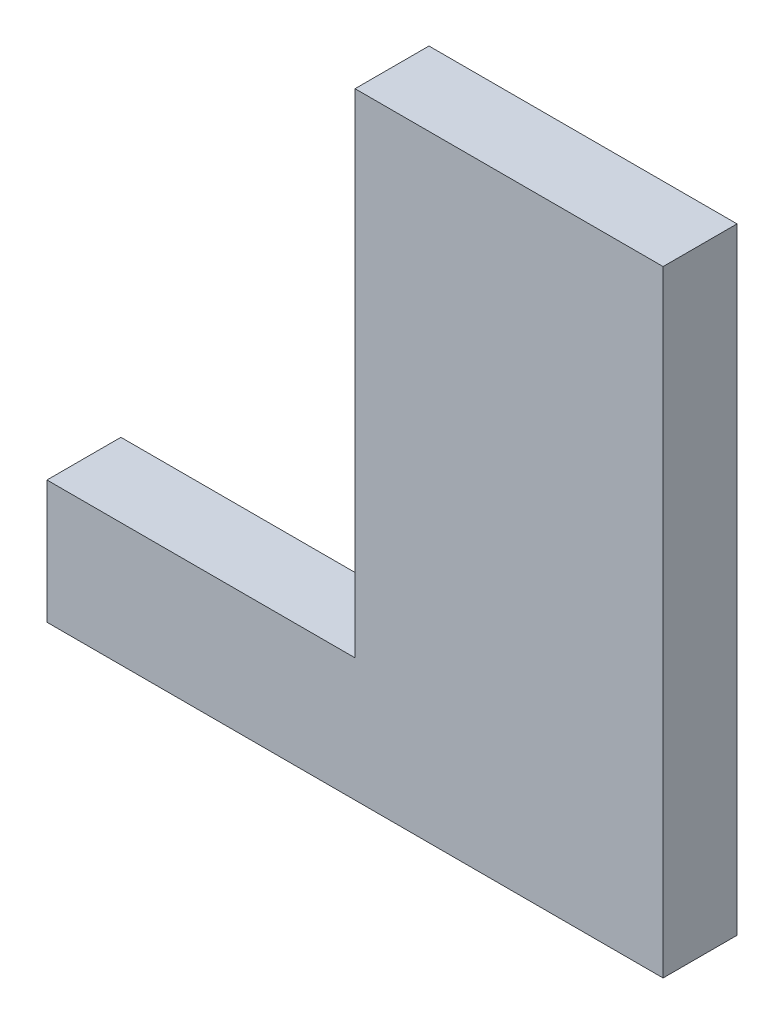
ISO-10303-21;
HEADER;
FILE_DESCRIPTION(('STEP AP214'),'2;1');
FILE_NAME('part.step','',(''),(''),'','','');
FILE_SCHEMA(('AUTOMOTIVE_DESIGN { 1 0 10303 214 1 1 1 1 }'));
ENDSEC;
DATA;
#1=APPLICATION_CONTEXT('core data for automotive mechanical design processes');
#2=APPLICATION_PROTOCOL_DEFINITION('international standard','automotive_design',2000,#1);
#3=PRODUCT_CONTEXT('',#1,'mechanical');
#4=PRODUCT('Part','Part','',(#3));
#5=PRODUCT_RELATED_PRODUCT_CATEGORY('part','',(#4));
#6=PRODUCT_DEFINITION_FORMATION('','',#4);
#7=PRODUCT_DEFINITION_CONTEXT('part definition',#1,'design');
#8=PRODUCT_DEFINITION('design','',#6,#7);
#9=PRODUCT_DEFINITION_SHAPE('','',#8);
#10=(LENGTH_UNIT() NAMED_UNIT(*) SI_UNIT(.MILLI.,.METRE.));
#11=(NAMED_UNIT(*) PLANE_ANGLE_UNIT() SI_UNIT($,.RADIAN.));
#12=(NAMED_UNIT(*) SI_UNIT($,.STERADIAN.) SOLID_ANGLE_UNIT());
#13=UNCERTAINTY_MEASURE_WITH_UNIT(LENGTH_MEASURE(1.E-05),#10,'distance_accuracy_value','');
#14=(GEOMETRIC_REPRESENTATION_CONTEXT(3) GLOBAL_UNCERTAINTY_ASSIGNED_CONTEXT((#13)) GLOBAL_UNIT_ASSIGNED_CONTEXT((#10,
#11,#12)) REPRESENTATION_CONTEXT('',''));
#15=CARTESIAN_POINT('',(0.,0.,0.));
#16=DIRECTION('',(0.,0.,1.));
#17=DIRECTION('',(1.,0.,0.));
#18=AXIS2_PLACEMENT_3D('',#15,#16,#17);
#19=CARTESIAN_POINT('',(0.,25.,-1.5));
#20=DIRECTION('',(0.,0.,-1.));
#21=DIRECTION('',(-1.,0.,0.));
#22=AXIS2_PLACEMENT_3D('',#19,#20,#21);
#23=PLANE('',#22);
#24=DIRECTION('',(1.,0.,0.));
#25=VECTOR('',#24,1.);
#26=CARTESIAN_POINT('',(0.,0.,-1.5));
#27=LINE('',#26,#25);
#28=CARTESIAN_POINT('',(-12.5,0.,-1.5));
#29=VERTEX_POINT('',#28);
#30=CARTESIAN_POINT('',(12.5,0.,-1.5));
#31=VERTEX_POINT('',#30);
#32=EDGE_CURVE('E135',#29,#31,#27,.T.);
#33=ORIENTED_EDGE('',*,*,#32,.F.);
#34=DIRECTION('',(0.,-1.,0.));
#35=VECTOR('',#34,1.);
#36=CARTESIAN_POINT('',(-12.5,5.,-1.5));
#37=LINE('',#36,#35);
#38=CARTESIAN_POINT('',(-12.5,5.,-1.5));
#39=VERTEX_POINT('',#38);
#40=EDGE_CURVE('E110',#39,#29,#37,.T.);
#41=ORIENTED_EDGE('',*,*,#40,.F.);
#42=DIRECTION('',(1.,0.,0.));
#43=VECTOR('',#42,1.);
#44=CARTESIAN_POINT('',(0.,5.,-1.5));
#45=LINE('',#44,#43);
#46=CARTESIAN_POINT('',(0.,5.,-1.5));
#47=VERTEX_POINT('',#46);
#48=EDGE_CURVE('E101',#39,#47,#45,.T.);
#49=ORIENTED_EDGE('',*,*,#48,.T.);
#50=DIRECTION('',(0.,-1.,0.));
#51=VECTOR('',#50,1.);
#52=CARTESIAN_POINT('',(0.,25.,-1.5));
#53=LINE('',#52,#51);
#54=CARTESIAN_POINT('',(0.,25.,-1.5));
#55=VERTEX_POINT('',#54);
#56=EDGE_CURVE('E11',#55,#47,#53,.T.);
#57=ORIENTED_EDGE('',*,*,#56,.F.);
#58=DIRECTION('',(1.,0.,0.));
#59=VECTOR('',#58,1.);
#60=CARTESIAN_POINT('',(0.,25.,-1.5));
#61=LINE('',#60,#59);
#62=CARTESIAN_POINT('',(12.5,25.,-1.5));
#63=VERTEX_POINT('',#62);
#64=EDGE_CURVE('E119',#55,#63,#61,.T.);
#65=ORIENTED_EDGE('',*,*,#64,.T.);
#66=DIRECTION('',(0.,-1.,0.));
#67=VECTOR('',#66,1.);
#68=CARTESIAN_POINT('',(12.5,25.,-1.5));
#69=LINE('',#68,#67);
#70=EDGE_CURVE('E79',#63,#31,#69,.T.);
#71=ORIENTED_EDGE('',*,*,#70,.T.);
#72=EDGE_LOOP('',(#33,#41,#49,#57,#65,#71));
#73=FACE_BOUND('',#72,.T.);
#74=ADVANCED_FACE('F40',(#73),#23,.T.);
#75=CARTESIAN_POINT('',(0.,25.,0.));
#76=DIRECTION('',(1.,0.,0.));
#77=DIRECTION('',(0.,0.,-1.));
#78=AXIS2_PLACEMENT_3D('',#75,#76,#77);
#79=PLANE('',#78);
#80=ORIENTED_EDGE('',*,*,#56,.T.);
#81=DIRECTION('',(0.,0.,1.));
#82=VECTOR('',#81,1.);
#83=CARTESIAN_POINT('',(0.,5.,0.));
#84=LINE('',#83,#82);
#85=CARTESIAN_POINT('',(0.,5.,1.5));
#86=VERTEX_POINT('',#85);
#87=EDGE_CURVE('E99',#47,#86,#84,.T.);
#88=ORIENTED_EDGE('',*,*,#87,.T.);
#89=DIRECTION('',(0.,-1.,0.));
#90=VECTOR('',#89,1.);
#91=CARTESIAN_POINT('',(0.,25.,1.5));
#92=LINE('',#91,#90);
#93=CARTESIAN_POINT('',(0.,25.,1.5));
#94=VERTEX_POINT('',#93);
#95=EDGE_CURVE('E48',#94,#86,#92,.T.);
#96=ORIENTED_EDGE('',*,*,#95,.F.);
#97=DIRECTION('',(0.,0.,1.));
#98=VECTOR('',#97,1.);
#99=CARTESIAN_POINT('',(0.,25.,0.));
#100=LINE('',#99,#98);
#101=EDGE_CURVE('E115',#55,#94,#100,.T.);
#102=ORIENTED_EDGE('',*,*,#101,.F.);
#103=EDGE_LOOP('',(#80,#88,#96,#102));
#104=FACE_BOUND('',#103,.T.);
#105=ADVANCED_FACE('F114',(#104),#79,.F.);
#106=CARTESIAN_POINT('',(0.,25.,1.5));
#107=DIRECTION('',(0.,0.,-1.));
#108=DIRECTION('',(-1.,0.,0.));
#109=AXIS2_PLACEMENT_3D('',#106,#107,#108);
#110=PLANE('',#109);
#111=DIRECTION('',(1.,0.,0.));
#112=VECTOR('',#111,1.);
#113=CARTESIAN_POINT('',(0.,0.,1.5));
#114=LINE('',#113,#112);
#115=CARTESIAN_POINT('',(-12.5,0.,1.5));
#116=VERTEX_POINT('',#115);
#117=CARTESIAN_POINT('',(12.5,0.,1.5));
#118=VERTEX_POINT('',#117);
#119=EDGE_CURVE('E126',#116,#118,#114,.T.);
#120=ORIENTED_EDGE('',*,*,#119,.T.);
#121=DIRECTION('',(0.,-1.,0.));
#122=VECTOR('',#121,1.);
#123=CARTESIAN_POINT('',(12.5,25.,1.5));
#124=LINE('',#123,#122);
#125=CARTESIAN_POINT('',(12.5,25.,1.5));
#126=VERTEX_POINT('',#125);
#127=EDGE_CURVE('E143',#126,#118,#124,.T.);
#128=ORIENTED_EDGE('',*,*,#127,.F.);
#129=DIRECTION('',(1.,0.,0.));
#130=VECTOR('',#129,1.);
#131=CARTESIAN_POINT('',(0.,25.,1.5));
#132=LINE('',#131,#130);
#133=EDGE_CURVE('E118',#94,#126,#132,.T.);
#134=ORIENTED_EDGE('',*,*,#133,.F.);
#135=ORIENTED_EDGE('',*,*,#95,.T.);
#136=DIRECTION('',(1.,0.,0.));
#137=VECTOR('',#136,1.);
#138=CARTESIAN_POINT('',(0.,5.,1.5));
#139=LINE('',#138,#137);
#140=CARTESIAN_POINT('',(-12.5,5.,1.5));
#141=VERTEX_POINT('',#140);
#142=EDGE_CURVE('E55',#141,#86,#139,.T.);
#143=ORIENTED_EDGE('',*,*,#142,.F.);
#144=DIRECTION('',(0.,-1.,0.));
#145=VECTOR('',#144,1.);
#146=CARTESIAN_POINT('',(-12.5,5.,1.5));
#147=LINE('',#146,#145);
#148=EDGE_CURVE('E161',#141,#116,#147,.T.);
#149=ORIENTED_EDGE('',*,*,#148,.T.);
#150=EDGE_LOOP('',(#120,#128,#134,#135,#143,#149));
#151=FACE_BOUND('',#150,.T.);
#152=ADVANCED_FACE('F148',(#151),#110,.F.);
#153=CARTESIAN_POINT('',(12.5,25.,0.));
#154=DIRECTION('',(-1.,0.,0.));
#155=DIRECTION('',(0.,0.,1.));
#156=AXIS2_PLACEMENT_3D('',#153,#154,#155);
#157=PLANE('',#156);
#158=DIRECTION('',(0.,0.,-1.));
#159=VECTOR('',#158,1.);
#160=CARTESIAN_POINT('',(12.5,0.,0.));
#161=LINE('',#160,#159);
#162=EDGE_CURVE('E123',#118,#31,#161,.T.);
#163=ORIENTED_EDGE('',*,*,#162,.T.);
#164=ORIENTED_EDGE('',*,*,#70,.F.);
#165=DIRECTION('',(0.,0.,-1.));
#166=VECTOR('',#165,1.);
#167=CARTESIAN_POINT('',(12.5,25.,0.));
#168=LINE('',#167,#166);
#169=EDGE_CURVE('E64',#126,#63,#168,.T.);
#170=ORIENTED_EDGE('',*,*,#169,.F.);
#171=ORIENTED_EDGE('',*,*,#127,.T.);
#172=EDGE_LOOP('',(#163,#164,#170,#171));
#173=FACE_BOUND('',#172,.T.);
#174=ADVANCED_FACE('F153',(#173),#157,.F.);
#175=CARTESIAN_POINT('',(0.,25.,0.));
#176=DIRECTION('',(0.,1.,0.));
#177=DIRECTION('',(0.,0.,1.));
#178=AXIS2_PLACEMENT_3D('',#175,#176,#177);
#179=PLANE('',#178);
#180=ORIENTED_EDGE('',*,*,#64,.F.);
#181=ORIENTED_EDGE('',*,*,#101,.T.);
#182=ORIENTED_EDGE('',*,*,#133,.T.);
#183=ORIENTED_EDGE('',*,*,#169,.T.);
#184=EDGE_LOOP('',(#180,#181,#182,#183));
#185=FACE_BOUND('',#184,.T.);
#186=ADVANCED_FACE('F121',(#185),#179,.T.);
#187=CARTESIAN_POINT('',(0.,0.,0.));
#188=DIRECTION('',(0.,1.,0.));
#189=DIRECTION('',(0.,0.,1.));
#190=AXIS2_PLACEMENT_3D('',#187,#188,#189);
#191=PLANE('',#190);
#192=ORIENTED_EDGE('',*,*,#32,.T.);
#193=ORIENTED_EDGE('',*,*,#162,.F.);
#194=ORIENTED_EDGE('',*,*,#119,.F.);
#195=DIRECTION('',(0.,0.,-1.));
#196=VECTOR('',#195,1.);
#197=CARTESIAN_POINT('',(-12.5,0.,0.));
#198=LINE('',#197,#196);
#199=EDGE_CURVE('E107',#116,#29,#198,.T.);
#200=ORIENTED_EDGE('',*,*,#199,.T.);
#201=EDGE_LOOP('',(#192,#193,#194,#200));
#202=FACE_BOUND('',#201,.T.);
#203=ADVANCED_FACE('F156',(#202),#191,.F.);
#204=CARTESIAN_POINT('',(-12.5,5.,0.));
#205=DIRECTION('',(-1.,0.,0.));
#206=DIRECTION('',(0.,0.,1.));
#207=AXIS2_PLACEMENT_3D('',#204,#205,#206);
#208=PLANE('',#207);
#209=ORIENTED_EDGE('',*,*,#199,.F.);
#210=ORIENTED_EDGE('',*,*,#148,.F.);
#211=DIRECTION('',(0.,0.,-1.));
#212=VECTOR('',#211,1.);
#213=CARTESIAN_POINT('',(-12.5,5.,0.));
#214=LINE('',#213,#212);
#215=EDGE_CURVE('E112',#141,#39,#214,.T.);
#216=ORIENTED_EDGE('',*,*,#215,.T.);
#217=ORIENTED_EDGE('',*,*,#40,.T.);
#218=EDGE_LOOP('',(#209,#210,#216,#217));
#219=FACE_BOUND('',#218,.T.);
#220=ADVANCED_FACE('F159',(#219),#208,.T.);
#221=CARTESIAN_POINT('',(0.,5.,0.));
#222=DIRECTION('',(0.,1.,0.));
#223=DIRECTION('',(0.,0.,1.));
#224=AXIS2_PLACEMENT_3D('',#221,#222,#223);
#225=PLANE('',#224);
#226=ORIENTED_EDGE('',*,*,#87,.F.);
#227=ORIENTED_EDGE('',*,*,#48,.F.);
#228=ORIENTED_EDGE('',*,*,#215,.F.);
#229=ORIENTED_EDGE('',*,*,#142,.T.);
#230=EDGE_LOOP('',(#226,#227,#228,#229));
#231=FACE_BOUND('',#230,.T.);
#232=ADVANCED_FACE('F100',(#231),#225,.T.);
#233=CLOSED_SHELL('',(#74,#105,#152,#174,#186,#203,#220,#232));
#234=MANIFOLD_SOLID_BREP('B2',#233);
#235=ADVANCED_BREP_SHAPE_REPRESENTATION('',(#18,#234),#14);
#236=SHAPE_DEFINITION_REPRESENTATION(#9,#235);
ENDSEC;
END-ISO-10303-21;
